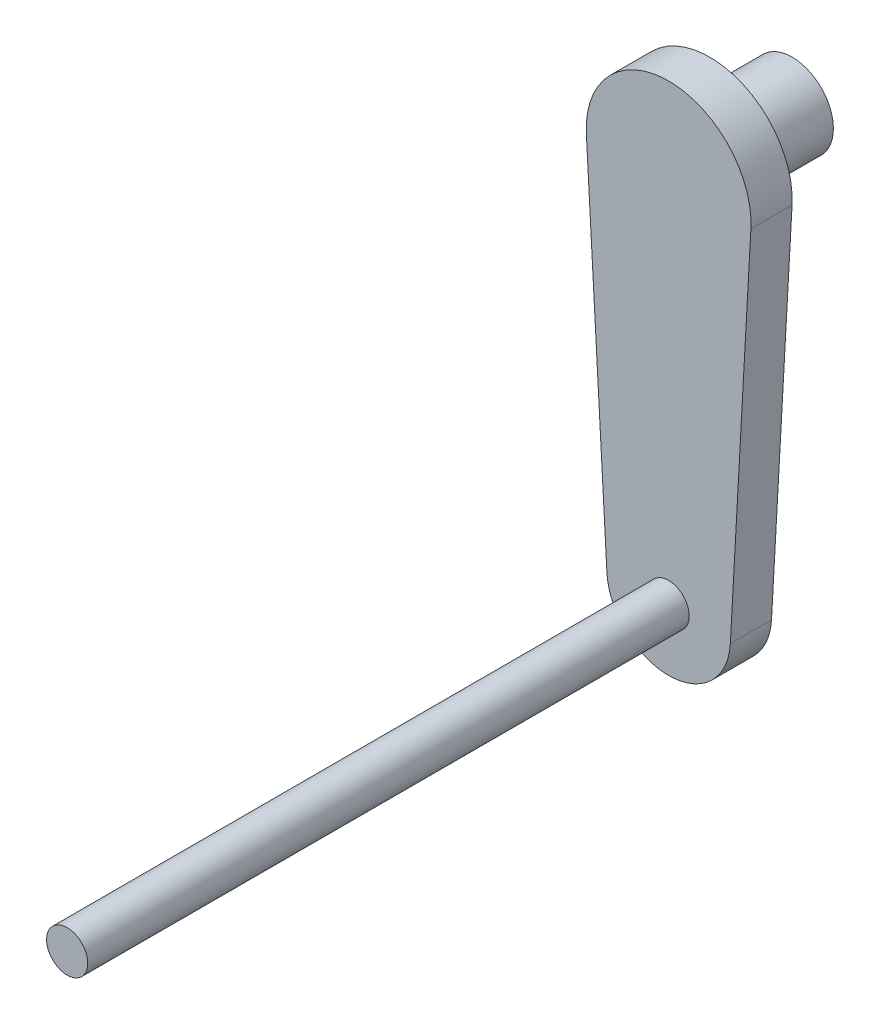
ISO-10303-21;
HEADER;
FILE_DESCRIPTION(('STEP AP214'),'2;1');
FILE_NAME('part.step','',(''),(''),'','','');
FILE_SCHEMA(('AUTOMOTIVE_DESIGN { 1 0 10303 214 1 1 1 1 }'));
ENDSEC;
DATA;
#1=APPLICATION_CONTEXT('core data for automotive mechanical design processes');
#2=APPLICATION_PROTOCOL_DEFINITION('international standard','automotive_design',2000,#1);
#3=PRODUCT_CONTEXT('',#1,'mechanical');
#4=PRODUCT('Part','Part','',(#3));
#5=PRODUCT_RELATED_PRODUCT_CATEGORY('part','',(#4));
#6=PRODUCT_DEFINITION_FORMATION('','',#4);
#7=PRODUCT_DEFINITION_CONTEXT('part definition',#1,'design');
#8=PRODUCT_DEFINITION('design','',#6,#7);
#9=PRODUCT_DEFINITION_SHAPE('','',#8);
#10=(LENGTH_UNIT() NAMED_UNIT(*) SI_UNIT(.MILLI.,.METRE.));
#11=(NAMED_UNIT(*) PLANE_ANGLE_UNIT() SI_UNIT($,.RADIAN.));
#12=(NAMED_UNIT(*) SI_UNIT($,.STERADIAN.) SOLID_ANGLE_UNIT());
#13=UNCERTAINTY_MEASURE_WITH_UNIT(LENGTH_MEASURE(1.E-05),#10,'distance_accuracy_value','');
#14=(GEOMETRIC_REPRESENTATION_CONTEXT(3) GLOBAL_UNCERTAINTY_ASSIGNED_CONTEXT((#13)) GLOBAL_UNIT_ASSIGNED_CONTEXT((#10,
#11,#12)) REPRESENTATION_CONTEXT('',''));
#15=CARTESIAN_POINT('',(0.,0.,0.));
#16=DIRECTION('',(0.,0.,1.));
#17=DIRECTION('',(1.,0.,0.));
#18=AXIS2_PLACEMENT_3D('',#15,#16,#17);
#19=CARTESIAN_POINT('',(0.,0.,-30.6605122421383));
#20=DIRECTION('',(0.,0.,1.));
#21=DIRECTION('',(1.,0.,0.));
#22=AXIS2_PLACEMENT_3D('',#19,#20,#21);
#23=CYLINDRICAL_SURFACE('',#22,6.35);
#24=CARTESIAN_POINT('',(0.,0.,-12.7));
#25=DIRECTION('',(0.,0.,1.));
#26=DIRECTION('',(1.,0.,0.));
#27=AXIS2_PLACEMENT_3D('',#24,#25,#26);
#28=CIRCLE('',#27,6.35);
#29=CARTESIAN_POINT('',(6.35,0.,-12.7));
#30=VERTEX_POINT('',#29);
#31=EDGE_CURVE('E12',#30,#30,#28,.F.);
#32=ORIENTED_EDGE('',*,*,#31,.F.);
#33=EDGE_LOOP('',(#32));
#34=FACE_BOUND('',#33,.T.);
#35=CARTESIAN_POINT('',(0.,0.,0.));
#36=DIRECTION('',(0.,0.,1.));
#37=DIRECTION('',(1.,0.,0.));
#38=AXIS2_PLACEMENT_3D('',#35,#36,#37);
#39=CIRCLE('',#38,6.35);
#40=CARTESIAN_POINT('',(6.35,0.,0.));
#41=VERTEX_POINT('',#40);
#42=EDGE_CURVE('E45',#41,#41,#39,.T.);
#43=ORIENTED_EDGE('',*,*,#42,.F.);
#44=EDGE_LOOP('',(#43));
#45=FACE_BOUND('',#44,.T.);
#46=ADVANCED_FACE('F37',(#34,#45),#23,.T.);
#47=CARTESIAN_POINT('',(0.,-1.22124532708767E-12,-12.7));
#48=DIRECTION('',(0.,0.,1.));
#49=DIRECTION('',(1.,0.,0.));
#50=AXIS2_PLACEMENT_3D('',#47,#48,#49);
#51=PLANE('',#50);
#52=ORIENTED_EDGE('',*,*,#31,.T.);
#53=EDGE_LOOP('',(#52));
#54=FACE_BOUND('',#53,.T.);
#55=ADVANCED_FACE('F124',(#54),#51,.F.);
#56=CARTESIAN_POINT('',(-12.6803860886814,-0.705555555555562,6.35));
#57=DIRECTION('',(0.998455597533968,0.0555555555555561,0.));
#58=DIRECTION('',(-0.0555555555555561,0.998455597533968,0.));
#59=AXIS2_PLACEMENT_3D('',#56,#57,#58);
#60=PLANE('',#59);
#61=DIRECTION('',(0.0555555555555561,-0.998455597533968,0.));
#62=VECTOR('',#61,1.);
#63=CARTESIAN_POINT('',(-12.6803860886814,-0.705555555555562,0.));
#64=LINE('',#63,#62);
#65=CARTESIAN_POINT('',(-12.6803860886814,-0.705555555555563,0.));
#66=VERTEX_POINT('',#65);
#67=CARTESIAN_POINT('',(-9.51028956651105,-57.6791666666662,0.));
#68=VERTEX_POINT('',#67);
#69=EDGE_CURVE('E107',#66,#68,#64,.T.);
#70=ORIENTED_EDGE('',*,*,#69,.T.);
#71=DIRECTION('',(0.,0.,-1.));
#72=VECTOR('',#71,1.);
#73=CARTESIAN_POINT('',(-9.51028956651105,-57.6791666666662,6.35));
#74=LINE('',#73,#72);
#75=CARTESIAN_POINT('',(-9.51028956651105,-57.6791666666662,6.35));
#76=VERTEX_POINT('',#75);
#77=EDGE_CURVE('E96',#76,#68,#74,.T.);
#78=ORIENTED_EDGE('',*,*,#77,.F.);
#79=DIRECTION('',(0.0555555555555561,-0.998455597533968,0.));
#80=VECTOR('',#79,1.);
#81=CARTESIAN_POINT('',(-12.6803860886814,-0.705555555555562,6.35));
#82=LINE('',#81,#80);
#83=CARTESIAN_POINT('',(-12.6803860886814,-0.705555555555563,6.35));
#84=VERTEX_POINT('',#83);
#85=EDGE_CURVE('E86',#84,#76,#82,.T.);
#86=ORIENTED_EDGE('',*,*,#85,.F.);
#87=DIRECTION('',(0.,0.,-1.));
#88=VECTOR('',#87,1.);
#89=CARTESIAN_POINT('',(-12.6803860886814,-0.705555555555563,6.35));
#90=LINE('',#89,#88);
#91=EDGE_CURVE('E106',#84,#66,#90,.T.);
#92=ORIENTED_EDGE('',*,*,#91,.T.);
#93=EDGE_LOOP('',(#70,#78,#86,#92));
#94=FACE_BOUND('',#93,.T.);
#95=ADVANCED_FACE('F129',(#94),#60,.F.);
#96=CARTESIAN_POINT('',(0.,-57.1499999999995,6.35));
#97=DIRECTION('',(0.,0.,-1.));
#98=DIRECTION('',(-1.,0.,0.));
#99=AXIS2_PLACEMENT_3D('',#96,#97,#98);
#100=CYLINDRICAL_SURFACE('',#99,9.52499999999999);
#101=CARTESIAN_POINT('',(0.,-57.1499999999995,0.));
#102=DIRECTION('',(0.,0.,1.));
#103=DIRECTION('',(1.,0.,0.));
#104=AXIS2_PLACEMENT_3D('',#101,#102,#103);
#105=CIRCLE('',#104,9.52499999999999);
#106=CARTESIAN_POINT('',(9.51028956651106,-57.6791666666662,0.));
#107=VERTEX_POINT('',#106);
#108=EDGE_CURVE('E92',#68,#107,#105,.T.);
#109=ORIENTED_EDGE('',*,*,#108,.T.);
#110=DIRECTION('',(0.,0.,-1.));
#111=VECTOR('',#110,1.);
#112=CARTESIAN_POINT('',(9.51028956651106,-57.6791666666662,6.35));
#113=LINE('',#112,#111);
#114=CARTESIAN_POINT('',(9.51028956651106,-57.6791666666662,6.35));
#115=VERTEX_POINT('',#114);
#116=EDGE_CURVE('E90',#115,#107,#113,.T.);
#117=ORIENTED_EDGE('',*,*,#116,.F.);
#118=CARTESIAN_POINT('',(0.,-57.1499999999995,6.35));
#119=DIRECTION('',(0.,0.,1.));
#120=DIRECTION('',(1.,0.,0.));
#121=AXIS2_PLACEMENT_3D('',#118,#119,#120);
#122=CIRCLE('',#121,9.52499999999999);
#123=EDGE_CURVE('E80',#76,#115,#122,.T.);
#124=ORIENTED_EDGE('',*,*,#123,.F.);
#125=ORIENTED_EDGE('',*,*,#77,.T.);
#126=EDGE_LOOP('',(#109,#117,#124,#125));
#127=FACE_BOUND('',#126,.T.);
#128=ADVANCED_FACE('F91',(#127),#100,.T.);
#129=CARTESIAN_POINT('',(12.6803860886814,-0.705555555555559,6.35));
#130=DIRECTION('',(0.998455597533968,-0.0555555555555558,0.));
#131=DIRECTION('',(0.0555555555555558,0.998455597533968,0.));
#132=AXIS2_PLACEMENT_3D('',#129,#130,#131);
#133=PLANE('',#132);
#134=DIRECTION('',(-0.0555555555555558,-0.998455597533968,0.));
#135=VECTOR('',#134,1.);
#136=CARTESIAN_POINT('',(12.6803860886814,-0.705555555555559,0.));
#137=LINE('',#136,#135);
#138=CARTESIAN_POINT('',(12.6803860886814,-0.70555555555556,0.));
#139=VERTEX_POINT('',#138);
#140=EDGE_CURVE('E112',#139,#107,#137,.T.);
#141=ORIENTED_EDGE('',*,*,#140,.F.);
#142=DIRECTION('',(0.,0.,-1.));
#143=VECTOR('',#142,1.);
#144=CARTESIAN_POINT('',(12.6803860886814,-0.70555555555556,6.35));
#145=LINE('',#144,#143);
#146=CARTESIAN_POINT('',(12.6803860886814,-0.70555555555556,6.35));
#147=VERTEX_POINT('',#146);
#148=EDGE_CURVE('E69',#147,#139,#145,.T.);
#149=ORIENTED_EDGE('',*,*,#148,.F.);
#150=DIRECTION('',(-0.0555555555555558,-0.998455597533968,0.));
#151=VECTOR('',#150,1.);
#152=CARTESIAN_POINT('',(12.6803860886814,-0.705555555555559,6.35));
#153=LINE('',#152,#151);
#154=EDGE_CURVE('E84',#147,#115,#153,.T.);
#155=ORIENTED_EDGE('',*,*,#154,.T.);
#156=ORIENTED_EDGE('',*,*,#116,.T.);
#157=EDGE_LOOP('',(#141,#149,#155,#156));
#158=FACE_BOUND('',#157,.T.);
#159=ADVANCED_FACE('F98',(#158),#133,.T.);
#160=CARTESIAN_POINT('',(0.,0.,6.35));
#161=DIRECTION('',(0.,0.,-1.));
#162=DIRECTION('',(-1.,0.,0.));
#163=AXIS2_PLACEMENT_3D('',#160,#161,#162);
#164=CYLINDRICAL_SURFACE('',#163,12.7);
#165=CARTESIAN_POINT('',(0.,0.,0.));
#166=DIRECTION('',(0.,0.,1.));
#167=DIRECTION('',(1.,0.,0.));
#168=AXIS2_PLACEMENT_3D('',#165,#166,#167);
#169=CIRCLE('',#168,12.7);
#170=EDGE_CURVE('E72',#139,#66,#169,.T.);
#171=ORIENTED_EDGE('',*,*,#170,.T.);
#172=ORIENTED_EDGE('',*,*,#91,.F.);
#173=CARTESIAN_POINT('',(0.,0.,6.35));
#174=DIRECTION('',(0.,0.,1.));
#175=DIRECTION('',(1.,0.,0.));
#176=AXIS2_PLACEMENT_3D('',#173,#174,#175);
#177=CIRCLE('',#176,12.7);
#178=EDGE_CURVE('E53',#147,#84,#177,.T.);
#179=ORIENTED_EDGE('',*,*,#178,.F.);
#180=ORIENTED_EDGE('',*,*,#148,.T.);
#181=EDGE_LOOP('',(#171,#172,#179,#180));
#182=FACE_BOUND('',#181,.T.);
#183=ADVANCED_FACE('F142',(#182),#164,.T.);
#184=CARTESIAN_POINT('',(0.,0.,6.35));
#185=DIRECTION('',(0.,0.,1.));
#186=DIRECTION('',(1.,0.,0.));
#187=AXIS2_PLACEMENT_3D('',#184,#185,#186);
#188=PLANE('',#187);
#189=ORIENTED_EDGE('',*,*,#85,.T.);
#190=ORIENTED_EDGE('',*,*,#123,.T.);
#191=ORIENTED_EDGE('',*,*,#154,.F.);
#192=ORIENTED_EDGE('',*,*,#178,.T.);
#193=EDGE_LOOP('',(#189,#190,#191,#192));
#194=FACE_BOUND('',#193,.T.);
#195=CARTESIAN_POINT('',(0.,-57.1499999999995,6.35));
#196=DIRECTION('',(0.,0.,1.));
#197=DIRECTION('',(1.,0.,0.));
#198=AXIS2_PLACEMENT_3D('',#195,#196,#197);
#199=CIRCLE('',#198,3.175);
#200=CARTESIAN_POINT('',(3.17500000000001,-57.1499999999995,6.35));
#201=VERTEX_POINT('',#200);
#202=EDGE_CURVE('E100',#201,#201,#199,.T.);
#203=ORIENTED_EDGE('',*,*,#202,.F.);
#204=EDGE_LOOP('',(#203));
#205=FACE_BOUND('',#204,.T.);
#206=ADVANCED_FACE('F81',(#194,#205),#188,.T.);
#207=CARTESIAN_POINT('',(0.,0.,0.));
#208=DIRECTION('',(0.,0.,1.));
#209=DIRECTION('',(1.,0.,0.));
#210=AXIS2_PLACEMENT_3D('',#207,#208,#209);
#211=PLANE('',#210);
#212=ORIENTED_EDGE('',*,*,#42,.T.);
#213=EDGE_LOOP('',(#212));
#214=FACE_BOUND('',#213,.T.);
#215=ORIENTED_EDGE('',*,*,#69,.F.);
#216=ORIENTED_EDGE('',*,*,#170,.F.);
#217=ORIENTED_EDGE('',*,*,#140,.T.);
#218=ORIENTED_EDGE('',*,*,#108,.F.);
#219=EDGE_LOOP('',(#215,#216,#217,#218));
#220=FACE_BOUND('',#219,.T.);
#221=ADVANCED_FACE('F120',(#214,#220),#211,.F.);
#222=CARTESIAN_POINT('',(0.,-57.1499999999995,110.580256121069));
#223=DIRECTION('',(0.,0.,-1.));
#224=DIRECTION('',(-1.,0.,0.));
#225=AXIS2_PLACEMENT_3D('',#222,#223,#224);
#226=CYLINDRICAL_SURFACE('',#225,3.175);
#227=ORIENTED_EDGE('',*,*,#202,.T.);
#228=EDGE_LOOP('',(#227));
#229=FACE_BOUND('',#228,.T.);
#230=CARTESIAN_POINT('',(0.,-57.1499999999995,99.06));
#231=DIRECTION('',(0.,0.,1.));
#232=DIRECTION('',(1.,0.,0.));
#233=AXIS2_PLACEMENT_3D('',#230,#231,#232);
#234=CIRCLE('',#233,3.175);
#235=CARTESIAN_POINT('',(3.17500000000001,-57.1499999999995,99.06));
#236=VERTEX_POINT('',#235);
#237=EDGE_CURVE('E110',#236,#236,#234,.T.);
#238=ORIENTED_EDGE('',*,*,#237,.F.);
#239=EDGE_LOOP('',(#238));
#240=FACE_BOUND('',#239,.T.);
#241=ADVANCED_FACE('F147',(#229,#240),#226,.T.);
#242=CARTESIAN_POINT('',(0.,-1.22124532708767E-12,99.06));
#243=DIRECTION('',(0.,0.,1.));
#244=DIRECTION('',(1.,0.,0.));
#245=AXIS2_PLACEMENT_3D('',#242,#243,#244);
#246=PLANE('',#245);
#247=ORIENTED_EDGE('',*,*,#237,.T.);
#248=EDGE_LOOP('',(#247));
#249=FACE_BOUND('',#248,.T.);
#250=ADVANCED_FACE('F150',(#249),#246,.T.);
#251=CLOSED_SHELL('',(#46,#55,#95,#128,#159,#183,#206,#221,#241,#250));
#252=MANIFOLD_SOLID_BREP('B2',#251);
#253=ADVANCED_BREP_SHAPE_REPRESENTATION('',(#18,#252),#14);
#254=SHAPE_DEFINITION_REPRESENTATION(#9,#253);
ENDSEC;
END-ISO-10303-21;
